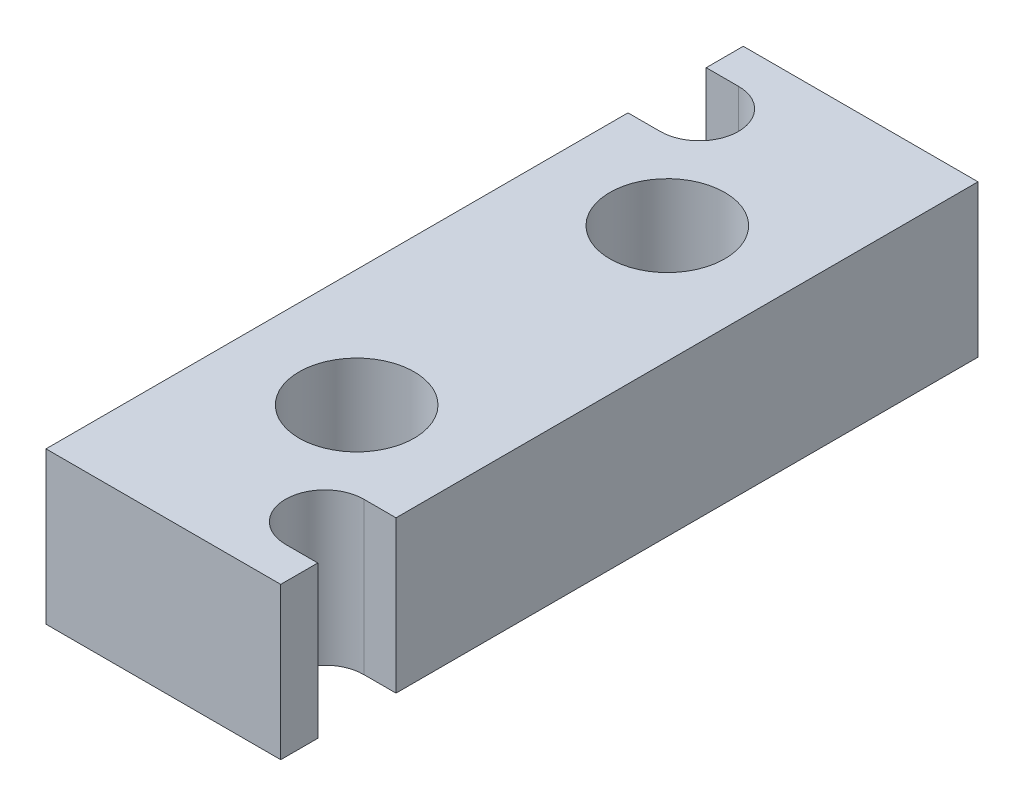
ISO-10303-21;
HEADER;
FILE_DESCRIPTION(('STEP AP214'),'2;1');
FILE_NAME('part.step','',(''),(''),'','','');
FILE_SCHEMA(('AUTOMOTIVE_DESIGN { 1 0 10303 214 1 1 1 1 }'));
ENDSEC;
DATA;
#1=APPLICATION_CONTEXT('core data for automotive mechanical design processes');
#2=APPLICATION_PROTOCOL_DEFINITION('international standard','automotive_design',2000,#1);
#3=PRODUCT_CONTEXT('',#1,'mechanical');
#4=PRODUCT('Part','Part','',(#3));
#5=PRODUCT_RELATED_PRODUCT_CATEGORY('part','',(#4));
#6=PRODUCT_DEFINITION_FORMATION('','',#4);
#7=PRODUCT_DEFINITION_CONTEXT('part definition',#1,'design');
#8=PRODUCT_DEFINITION('design','',#6,#7);
#9=PRODUCT_DEFINITION_SHAPE('','',#8);
#10=(LENGTH_UNIT() NAMED_UNIT(*) SI_UNIT(.MILLI.,.METRE.));
#11=(NAMED_UNIT(*) PLANE_ANGLE_UNIT() SI_UNIT($,.RADIAN.));
#12=(NAMED_UNIT(*) SI_UNIT($,.STERADIAN.) SOLID_ANGLE_UNIT());
#13=UNCERTAINTY_MEASURE_WITH_UNIT(LENGTH_MEASURE(1.E-05),#10,'distance_accuracy_value','');
#14=(GEOMETRIC_REPRESENTATION_CONTEXT(3) GLOBAL_UNCERTAINTY_ASSIGNED_CONTEXT((#13)) GLOBAL_UNIT_ASSIGNED_CONTEXT((#10,
#11,#12)) REPRESENTATION_CONTEXT('',''));
#15=CARTESIAN_POINT('',(0.,0.,0.));
#16=DIRECTION('',(0.,0.,1.));
#17=DIRECTION('',(1.,0.,0.));
#18=AXIS2_PLACEMENT_3D('',#15,#16,#17);
#19=CARTESIAN_POINT('',(-5.1,6.6,0.));
#20=DIRECTION('',(0.,1.,0.));
#21=DIRECTION('',(0.,0.,1.));
#22=AXIS2_PLACEMENT_3D('',#19,#20,#21);
#23=PLANE('',#22);
#24=CARTESIAN_POINT('',(0.,6.6,-6.75));
#25=DIRECTION('',(0.,1.,0.));
#26=DIRECTION('',(0.,0.,-1.));
#27=AXIS2_PLACEMENT_3D('',#24,#25,#26);
#28=CIRCLE('',#27,2.5);
#29=CARTESIAN_POINT('',(0.,6.6,-9.25));
#30=VERTEX_POINT('',#29);
#31=EDGE_CURVE('E143',#30,#30,#28,.T.);
#32=ORIENTED_EDGE('',*,*,#31,.F.);
#33=EDGE_LOOP('',(#32));
#34=FACE_BOUND('',#33,.T.);
#35=CARTESIAN_POINT('',(0.,6.6,6.75));
#36=DIRECTION('',(0.,1.,0.));
#37=DIRECTION('',(0.,0.,1.));
#38=AXIS2_PLACEMENT_3D('',#35,#36,#37);
#39=CIRCLE('',#38,2.5);
#40=CARTESIAN_POINT('',(0.,6.6,9.25));
#41=VERTEX_POINT('',#40);
#42=EDGE_CURVE('E171',#41,#41,#39,.T.);
#43=ORIENTED_EDGE('',*,*,#42,.F.);
#44=EDGE_LOOP('',(#43));
#45=FACE_BOUND('',#44,.T.);
#46=DIRECTION('',(0.,0.,1.));
#47=VECTOR('',#46,1.);
#48=CARTESIAN_POINT('',(-5.1,6.6,0.));
#49=LINE('',#48,#47);
#50=CARTESIAN_POINT('',(-5.1,6.6,-15.15));
#51=VERTEX_POINT('',#50);
#52=CARTESIAN_POINT('',(-5.10000000000009,6.6,-13.54));
#53=VERTEX_POINT('',#52);
#54=EDGE_CURVE('E196',#51,#53,#49,.T.);
#55=ORIENTED_EDGE('',*,*,#54,.T.);
#56=DIRECTION('',(-1.,0.,0.));
#57=VECTOR('',#56,1.);
#58=CARTESIAN_POINT('',(-3.70000000000009,6.6,-13.54));
#59=LINE('',#58,#57);
#60=CARTESIAN_POINT('',(-3.70000000000009,6.6,-13.54));
#61=VERTEX_POINT('',#60);
#62=EDGE_CURVE('E132',#61,#53,#59,.T.);
#63=ORIENTED_EDGE('',*,*,#62,.F.);
#64=CARTESIAN_POINT('',(-3.70000000000008,6.6,-11.84));
#65=DIRECTION('',(0.,1.,0.));
#66=DIRECTION('',(0.,0.,-1.));
#67=AXIS2_PLACEMENT_3D('',#64,#65,#66);
#68=CIRCLE('',#67,1.7);
#69=CARTESIAN_POINT('',(-3.70000000000007,6.6,-10.14));
#70=VERTEX_POINT('',#69);
#71=EDGE_CURVE('E123',#70,#61,#68,.T.);
#72=ORIENTED_EDGE('',*,*,#71,.F.);
#73=DIRECTION('',(1.,0.,0.));
#74=VECTOR('',#73,1.);
#75=CARTESIAN_POINT('',(-3.70000000000007,6.6,-10.14));
#76=LINE('',#75,#74);
#77=CARTESIAN_POINT('',(-5.10000000000007,6.6,-10.14));
#78=VERTEX_POINT('',#77);
#79=EDGE_CURVE('E134',#78,#70,#76,.T.);
#80=ORIENTED_EDGE('',*,*,#79,.F.);
#81=CARTESIAN_POINT('',(-5.1,6.6,15.15));
#82=VERTEX_POINT('',#81);
#83=EDGE_CURVE('E195',#78,#82,#49,.T.);
#84=ORIENTED_EDGE('',*,*,#83,.T.);
#85=DIRECTION('',(1.,0.,0.));
#86=VECTOR('',#85,1.);
#87=CARTESIAN_POINT('',(-5.1,6.6,15.15));
#88=LINE('',#87,#86);
#89=CARTESIAN_POINT('',(5.1,6.6,15.15));
#90=VERTEX_POINT('',#89);
#91=EDGE_CURVE('E199',#82,#90,#88,.T.);
#92=ORIENTED_EDGE('',*,*,#91,.T.);
#93=DIRECTION('',(0.,0.,-1.));
#94=VECTOR('',#93,1.);
#95=CARTESIAN_POINT('',(5.1,6.6,0.));
#96=LINE('',#95,#94);
#97=CARTESIAN_POINT('',(5.1,6.6,13.54));
#98=VERTEX_POINT('',#97);
#99=EDGE_CURVE('E202',#90,#98,#96,.T.);
#100=ORIENTED_EDGE('',*,*,#99,.T.);
#101=DIRECTION('',(1.,0.,0.));
#102=VECTOR('',#101,1.);
#103=CARTESIAN_POINT('',(3.7,6.6,13.54));
#104=LINE('',#103,#102);
#105=CARTESIAN_POINT('',(3.7,6.6,13.54));
#106=VERTEX_POINT('',#105);
#107=EDGE_CURVE('E155',#106,#98,#104,.T.);
#108=ORIENTED_EDGE('',*,*,#107,.F.);
#109=CARTESIAN_POINT('',(3.7,6.6,11.84));
#110=DIRECTION('',(0.,1.,0.));
#111=DIRECTION('',(0.,0.,1.));
#112=AXIS2_PLACEMENT_3D('',#109,#110,#111);
#113=CIRCLE('',#112,1.7);
#114=CARTESIAN_POINT('',(3.7,6.6,10.14));
#115=VERTEX_POINT('',#114);
#116=EDGE_CURVE('E153',#115,#106,#113,.T.);
#117=ORIENTED_EDGE('',*,*,#116,.F.);
#118=DIRECTION('',(-1.,0.,0.));
#119=VECTOR('',#118,1.);
#120=CARTESIAN_POINT('',(3.7,6.6,10.14));
#121=LINE('',#120,#119);
#122=CARTESIAN_POINT('',(5.1,6.6,10.14));
#123=VERTEX_POINT('',#122);
#124=EDGE_CURVE('E157',#123,#115,#121,.T.);
#125=ORIENTED_EDGE('',*,*,#124,.F.);
#126=CARTESIAN_POINT('',(5.1,6.6,-15.15));
#127=VERTEX_POINT('',#126);
#128=EDGE_CURVE('E201',#123,#127,#96,.T.);
#129=ORIENTED_EDGE('',*,*,#128,.T.);
#130=DIRECTION('',(1.,0.,0.));
#131=VECTOR('',#130,1.);
#132=CARTESIAN_POINT('',(-5.1,6.6,-15.15));
#133=LINE('',#132,#131);
#134=EDGE_CURVE('E177',#51,#127,#133,.T.);
#135=ORIENTED_EDGE('',*,*,#134,.F.);
#136=EDGE_LOOP('',(#55,#63,#72,#80,#84,#92,#100,#108,#117,#125,#129,#135));
#137=FACE_BOUND('',#136,.T.);
#138=ADVANCED_FACE('F17',(#34,#45,#137),#23,.T.);
#139=CARTESIAN_POINT('',(-5.1,0.,0.));
#140=DIRECTION('',(0.,1.,0.));
#141=DIRECTION('',(0.,0.,1.));
#142=AXIS2_PLACEMENT_3D('',#139,#140,#141);
#143=PLANE('',#142);
#144=CARTESIAN_POINT('',(0.,0.,-6.75));
#145=DIRECTION('',(0.,1.,0.));
#146=DIRECTION('',(0.,0.,-1.));
#147=AXIS2_PLACEMENT_3D('',#144,#145,#146);
#148=CIRCLE('',#147,2.5);
#149=CARTESIAN_POINT('',(0.,0.,-9.25));
#150=VERTEX_POINT('',#149);
#151=EDGE_CURVE('E124',#150,#150,#148,.T.);
#152=ORIENTED_EDGE('',*,*,#151,.T.);
#153=EDGE_LOOP('',(#152));
#154=FACE_BOUND('',#153,.T.);
#155=CARTESIAN_POINT('',(0.,0.,6.75));
#156=DIRECTION('',(0.,1.,0.));
#157=DIRECTION('',(0.,0.,1.));
#158=AXIS2_PLACEMENT_3D('',#155,#156,#157);
#159=CIRCLE('',#158,2.5);
#160=CARTESIAN_POINT('',(0.,0.,9.25));
#161=VERTEX_POINT('',#160);
#162=EDGE_CURVE('E168',#161,#161,#159,.T.);
#163=ORIENTED_EDGE('',*,*,#162,.T.);
#164=EDGE_LOOP('',(#163));
#165=FACE_BOUND('',#164,.T.);
#166=DIRECTION('',(-1.,0.,0.));
#167=VECTOR('',#166,1.);
#168=CARTESIAN_POINT('',(-3.70000000000009,0.,-13.54));
#169=LINE('',#168,#167);
#170=CARTESIAN_POINT('',(-3.70000000000009,0.,-13.54));
#171=VERTEX_POINT('',#170);
#172=CARTESIAN_POINT('',(-5.10000000000009,0.,-13.54));
#173=VERTEX_POINT('',#172);
#174=EDGE_CURVE('E106',#171,#173,#169,.T.);
#175=ORIENTED_EDGE('',*,*,#174,.T.);
#176=DIRECTION('',(0.,0.,1.));
#177=VECTOR('',#176,1.);
#178=CARTESIAN_POINT('',(-5.1,0.,0.));
#179=LINE('',#178,#177);
#180=CARTESIAN_POINT('',(-5.1,0.,-15.15));
#181=VERTEX_POINT('',#180);
#182=EDGE_CURVE('E187',#181,#173,#179,.T.);
#183=ORIENTED_EDGE('',*,*,#182,.F.);
#184=DIRECTION('',(1.,0.,0.));
#185=VECTOR('',#184,1.);
#186=CARTESIAN_POINT('',(-5.1,0.,-15.15));
#187=LINE('',#186,#185);
#188=CARTESIAN_POINT('',(5.1,0.,-15.15));
#189=VERTEX_POINT('',#188);
#190=EDGE_CURVE('E174',#181,#189,#187,.T.);
#191=ORIENTED_EDGE('',*,*,#190,.T.);
#192=DIRECTION('',(0.,0.,-1.));
#193=VECTOR('',#192,1.);
#194=CARTESIAN_POINT('',(5.1,0.,0.));
#195=LINE('',#194,#193);
#196=CARTESIAN_POINT('',(5.1,0.,10.14));
#197=VERTEX_POINT('',#196);
#198=EDGE_CURVE('E191',#197,#189,#195,.T.);
#199=ORIENTED_EDGE('',*,*,#198,.F.);
#200=DIRECTION('',(-1.,0.,0.));
#201=VECTOR('',#200,1.);
#202=CARTESIAN_POINT('',(3.7,0.,10.14));
#203=LINE('',#202,#201);
#204=CARTESIAN_POINT('',(3.7,0.,10.14));
#205=VERTEX_POINT('',#204);
#206=EDGE_CURVE('E40',#197,#205,#203,.T.);
#207=ORIENTED_EDGE('',*,*,#206,.T.);
#208=CARTESIAN_POINT('',(3.7,0.,11.84));
#209=DIRECTION('',(0.,1.,0.));
#210=DIRECTION('',(0.,0.,1.));
#211=AXIS2_PLACEMENT_3D('',#208,#209,#210);
#212=CIRCLE('',#211,1.7);
#213=CARTESIAN_POINT('',(3.7,0.,13.54));
#214=VERTEX_POINT('',#213);
#215=EDGE_CURVE('E146',#205,#214,#212,.T.);
#216=ORIENTED_EDGE('',*,*,#215,.T.);
#217=DIRECTION('',(1.,0.,0.));
#218=VECTOR('',#217,1.);
#219=CARTESIAN_POINT('',(3.7,0.,13.54));
#220=LINE('',#219,#218);
#221=CARTESIAN_POINT('',(5.1,0.,13.54));
#222=VERTEX_POINT('',#221);
#223=EDGE_CURVE('E149',#214,#222,#220,.T.);
#224=ORIENTED_EDGE('',*,*,#223,.T.);
#225=CARTESIAN_POINT('',(5.1,0.,15.15));
#226=VERTEX_POINT('',#225);
#227=EDGE_CURVE('E192',#226,#222,#195,.T.);
#228=ORIENTED_EDGE('',*,*,#227,.F.);
#229=DIRECTION('',(1.,0.,0.));
#230=VECTOR('',#229,1.);
#231=CARTESIAN_POINT('',(-5.1,0.,15.15));
#232=LINE('',#231,#230);
#233=CARTESIAN_POINT('',(-5.1,0.,15.15));
#234=VERTEX_POINT('',#233);
#235=EDGE_CURVE('E189',#234,#226,#232,.T.);
#236=ORIENTED_EDGE('',*,*,#235,.F.);
#237=CARTESIAN_POINT('',(-5.1,0.,-10.14));
#238=VERTEX_POINT('',#237);
#239=EDGE_CURVE('E186',#238,#234,#179,.T.);
#240=ORIENTED_EDGE('',*,*,#239,.F.);
#241=DIRECTION('',(1.,0.,0.));
#242=VECTOR('',#241,1.);
#243=CARTESIAN_POINT('',(-3.70000000000007,0.,-10.14));
#244=LINE('',#243,#242);
#245=CARTESIAN_POINT('',(-3.70000000000007,0.,-10.14));
#246=VERTEX_POINT('',#245);
#247=EDGE_CURVE('E32',#238,#246,#244,.T.);
#248=ORIENTED_EDGE('',*,*,#247,.T.);
#249=CARTESIAN_POINT('',(-3.70000000000008,0.,-11.84));
#250=DIRECTION('',(0.,1.,0.));
#251=DIRECTION('',(0.,0.,-1.));
#252=AXIS2_PLACEMENT_3D('',#249,#250,#251);
#253=CIRCLE('',#252,1.7);
#254=EDGE_CURVE('E116',#246,#171,#253,.T.);
#255=ORIENTED_EDGE('',*,*,#254,.T.);
#256=EDGE_LOOP('',(#175,#183,#191,#199,#207,#216,#224,#228,#236,#240,#248,#255));
#257=FACE_BOUND('',#256,.T.);
#258=ADVANCED_FACE('F126',(#154,#165,#257),#143,.F.);
#259=CARTESIAN_POINT('',(-5.1,6.6,0.));
#260=DIRECTION('',(1.,0.,0.));
#261=DIRECTION('',(0.,0.,-1.));
#262=AXIS2_PLACEMENT_3D('',#259,#260,#261);
#263=PLANE('',#262);
#264=DIRECTION('',(0.,-1.,0.));
#265=VECTOR('',#264,1.);
#266=CARTESIAN_POINT('',(-5.10000000000009,6.6,-13.54));
#267=LINE('',#266,#265);
#268=EDGE_CURVE('E112',#53,#173,#267,.T.);
#269=ORIENTED_EDGE('',*,*,#268,.F.);
#270=ORIENTED_EDGE('',*,*,#54,.F.);
#271=DIRECTION('',(0.,-1.,0.));
#272=VECTOR('',#271,1.);
#273=CARTESIAN_POINT('',(-5.1,6.6,-15.15));
#274=LINE('',#273,#272);
#275=EDGE_CURVE('E183',#51,#181,#274,.T.);
#276=ORIENTED_EDGE('',*,*,#275,.T.);
#277=ORIENTED_EDGE('',*,*,#182,.T.);
#278=EDGE_LOOP('',(#269,#270,#276,#277));
#279=FACE_BOUND('',#278,.T.);
#280=ADVANCED_FACE('F19',(#279),#263,.F.);
#281=DIRECTION('',(0.,-1.,0.));
#282=VECTOR('',#281,1.);
#283=CARTESIAN_POINT('',(-5.10000000000007,6.6,-10.14));
#284=LINE('',#283,#282);
#285=EDGE_CURVE('E138',#78,#238,#284,.T.);
#286=ORIENTED_EDGE('',*,*,#285,.T.);
#287=ORIENTED_EDGE('',*,*,#239,.T.);
#288=DIRECTION('',(0.,-1.,0.));
#289=VECTOR('',#288,1.);
#290=CARTESIAN_POINT('',(-5.1,6.6,15.15));
#291=LINE('',#290,#289);
#292=EDGE_CURVE('E11',#82,#234,#291,.T.);
#293=ORIENTED_EDGE('',*,*,#292,.F.);
#294=ORIENTED_EDGE('',*,*,#83,.F.);
#295=EDGE_LOOP('',(#286,#287,#293,#294));
#296=FACE_BOUND('',#295,.T.);
#297=ADVANCED_FACE('F231',(#296),#263,.F.);
#298=CARTESIAN_POINT('',(5.1,6.6,0.));
#299=DIRECTION('',(-1.,0.,0.));
#300=DIRECTION('',(0.,0.,1.));
#301=AXIS2_PLACEMENT_3D('',#298,#299,#300);
#302=PLANE('',#301);
#303=DIRECTION('',(0.,-1.,0.));
#304=VECTOR('',#303,1.);
#305=CARTESIAN_POINT('',(5.1,6.6,13.54));
#306=LINE('',#305,#304);
#307=EDGE_CURVE('E163',#98,#222,#306,.T.);
#308=ORIENTED_EDGE('',*,*,#307,.F.);
#309=ORIENTED_EDGE('',*,*,#99,.F.);
#310=DIRECTION('',(0.,-1.,0.));
#311=VECTOR('',#310,1.);
#312=CARTESIAN_POINT('',(5.1,6.6,15.15));
#313=LINE('',#312,#311);
#314=EDGE_CURVE('E25',#90,#226,#313,.T.);
#315=ORIENTED_EDGE('',*,*,#314,.T.);
#316=ORIENTED_EDGE('',*,*,#227,.T.);
#317=EDGE_LOOP('',(#308,#309,#315,#316));
#318=FACE_BOUND('',#317,.T.);
#319=ADVANCED_FACE('F210',(#318),#302,.F.);
#320=DIRECTION('',(0.,-1.,0.));
#321=VECTOR('',#320,1.);
#322=CARTESIAN_POINT('',(5.1,6.6,10.14));
#323=LINE('',#322,#321);
#324=EDGE_CURVE('E161',#123,#197,#323,.T.);
#325=ORIENTED_EDGE('',*,*,#324,.T.);
#326=ORIENTED_EDGE('',*,*,#198,.T.);
#327=DIRECTION('',(0.,-1.,0.));
#328=VECTOR('',#327,1.);
#329=CARTESIAN_POINT('',(5.1,6.6,-15.15));
#330=LINE('',#329,#328);
#331=EDGE_CURVE('E180',#127,#189,#330,.T.);
#332=ORIENTED_EDGE('',*,*,#331,.F.);
#333=ORIENTED_EDGE('',*,*,#128,.F.);
#334=EDGE_LOOP('',(#325,#326,#332,#333));
#335=FACE_BOUND('',#334,.T.);
#336=ADVANCED_FACE('F242',(#335),#302,.F.);
#337=CARTESIAN_POINT('',(-5.1,6.6,15.15));
#338=DIRECTION('',(0.,0.,-1.));
#339=DIRECTION('',(-1.,0.,0.));
#340=AXIS2_PLACEMENT_3D('',#337,#338,#339);
#341=PLANE('',#340);
#342=ORIENTED_EDGE('',*,*,#235,.T.);
#343=ORIENTED_EDGE('',*,*,#314,.F.);
#344=ORIENTED_EDGE('',*,*,#91,.F.);
#345=ORIENTED_EDGE('',*,*,#292,.T.);
#346=EDGE_LOOP('',(#342,#343,#344,#345));
#347=FACE_BOUND('',#346,.T.);
#348=ADVANCED_FACE('F229',(#347),#341,.F.);
#349=CARTESIAN_POINT('',(-5.1,6.6,-15.15));
#350=DIRECTION('',(0.,0.,1.));
#351=DIRECTION('',(-1.,0.,0.));
#352=AXIS2_PLACEMENT_3D('',#349,#350,#351);
#353=PLANE('',#352);
#354=ORIENTED_EDGE('',*,*,#190,.F.);
#355=ORIENTED_EDGE('',*,*,#275,.F.);
#356=ORIENTED_EDGE('',*,*,#134,.T.);
#357=ORIENTED_EDGE('',*,*,#331,.T.);
#358=EDGE_LOOP('',(#354,#355,#356,#357));
#359=FACE_BOUND('',#358,.T.);
#360=ADVANCED_FACE('F239',(#359),#353,.F.);
#361=CARTESIAN_POINT('',(0.,6.6,6.75));
#362=DIRECTION('',(0.,-1.,0.));
#363=DIRECTION('',(0.,0.,-1.));
#364=AXIS2_PLACEMENT_3D('',#361,#362,#363);
#365=CYLINDRICAL_SURFACE('',#364,2.5);
#366=ORIENTED_EDGE('',*,*,#42,.T.);
#367=EDGE_LOOP('',(#366));
#368=FACE_BOUND('',#367,.T.);
#369=ORIENTED_EDGE('',*,*,#162,.F.);
#370=EDGE_LOOP('',(#369));
#371=FACE_BOUND('',#370,.T.);
#372=ADVANCED_FACE('F273',(#368,#371),#365,.F.);
#373=CARTESIAN_POINT('',(3.7,6.6,11.84));
#374=DIRECTION('',(0.,-1.,0.));
#375=DIRECTION('',(0.,0.,-1.));
#376=AXIS2_PLACEMENT_3D('',#373,#374,#375);
#377=CYLINDRICAL_SURFACE('',#376,1.7);
#378=ORIENTED_EDGE('',*,*,#215,.F.);
#379=DIRECTION('',(0.,-1.,0.));
#380=VECTOR('',#379,1.);
#381=CARTESIAN_POINT('',(3.7,6.6,10.14));
#382=LINE('',#381,#380);
#383=EDGE_CURVE('E159',#115,#205,#382,.T.);
#384=ORIENTED_EDGE('',*,*,#383,.F.);
#385=ORIENTED_EDGE('',*,*,#116,.T.);
#386=DIRECTION('',(0.,-1.,0.));
#387=VECTOR('',#386,1.);
#388=CARTESIAN_POINT('',(3.7,6.6,13.54));
#389=LINE('',#388,#387);
#390=EDGE_CURVE('E165',#106,#214,#389,.T.);
#391=ORIENTED_EDGE('',*,*,#390,.T.);
#392=EDGE_LOOP('',(#378,#384,#385,#391));
#393=FACE_BOUND('',#392,.T.);
#394=ADVANCED_FACE('F220',(#393),#377,.F.);
#395=CARTESIAN_POINT('',(3.7,6.6,13.54));
#396=DIRECTION('',(0.,0.,-1.));
#397=DIRECTION('',(-1.,0.,0.));
#398=AXIS2_PLACEMENT_3D('',#395,#396,#397);
#399=PLANE('',#398);
#400=ORIENTED_EDGE('',*,*,#223,.F.);
#401=ORIENTED_EDGE('',*,*,#390,.F.);
#402=ORIENTED_EDGE('',*,*,#107,.T.);
#403=ORIENTED_EDGE('',*,*,#307,.T.);
#404=EDGE_LOOP('',(#400,#401,#402,#403));
#405=FACE_BOUND('',#404,.T.);
#406=ADVANCED_FACE('F217',(#405),#399,.T.);
#407=CARTESIAN_POINT('',(3.7,6.6,10.14));
#408=DIRECTION('',(0.,0.,1.));
#409=DIRECTION('',(1.,0.,0.));
#410=AXIS2_PLACEMENT_3D('',#407,#408,#409);
#411=PLANE('',#410);
#412=ORIENTED_EDGE('',*,*,#206,.F.);
#413=ORIENTED_EDGE('',*,*,#324,.F.);
#414=ORIENTED_EDGE('',*,*,#124,.T.);
#415=ORIENTED_EDGE('',*,*,#383,.T.);
#416=EDGE_LOOP('',(#412,#413,#414,#415));
#417=FACE_BOUND('',#416,.T.);
#418=ADVANCED_FACE('F243',(#417),#411,.T.);
#419=CARTESIAN_POINT('',(0.,6.6,-6.75));
#420=DIRECTION('',(0.,-1.,0.));
#421=DIRECTION('',(0.,0.,-1.));
#422=AXIS2_PLACEMENT_3D('',#419,#420,#421);
#423=CYLINDRICAL_SURFACE('',#422,2.5);
#424=ORIENTED_EDGE('',*,*,#31,.T.);
#425=EDGE_LOOP('',(#424));
#426=FACE_BOUND('',#425,.T.);
#427=ORIENTED_EDGE('',*,*,#151,.F.);
#428=EDGE_LOOP('',(#427));
#429=FACE_BOUND('',#428,.T.);
#430=ADVANCED_FACE('F245',(#426,#429),#423,.F.);
#431=CARTESIAN_POINT('',(-3.70000000000008,6.6,-11.84));
#432=DIRECTION('',(0.,-1.,0.));
#433=DIRECTION('',(0.,0.,-1.));
#434=AXIS2_PLACEMENT_3D('',#431,#432,#433);
#435=CYLINDRICAL_SURFACE('',#434,1.7);
#436=ORIENTED_EDGE('',*,*,#254,.F.);
#437=DIRECTION('',(0.,-1.,0.));
#438=VECTOR('',#437,1.);
#439=CARTESIAN_POINT('',(-3.70000000000007,6.6,-10.14));
#440=LINE('',#439,#438);
#441=EDGE_CURVE('E136',#70,#246,#440,.T.);
#442=ORIENTED_EDGE('',*,*,#441,.F.);
#443=ORIENTED_EDGE('',*,*,#71,.T.);
#444=DIRECTION('',(0.,-1.,0.));
#445=VECTOR('',#444,1.);
#446=CARTESIAN_POINT('',(-3.70000000000009,6.6,-13.54));
#447=LINE('',#446,#445);
#448=EDGE_CURVE('E109',#61,#171,#447,.T.);
#449=ORIENTED_EDGE('',*,*,#448,.T.);
#450=EDGE_LOOP('',(#436,#442,#443,#449));
#451=FACE_BOUND('',#450,.T.);
#452=ADVANCED_FACE('F120',(#451),#435,.F.);
#453=CARTESIAN_POINT('',(-3.70000000000009,6.6,-13.54));
#454=DIRECTION('',(0.,0.,1.));
#455=DIRECTION('',(1.,0.,0.));
#456=AXIS2_PLACEMENT_3D('',#453,#454,#455);
#457=PLANE('',#456);
#458=ORIENTED_EDGE('',*,*,#174,.F.);
#459=ORIENTED_EDGE('',*,*,#448,.F.);
#460=ORIENTED_EDGE('',*,*,#62,.T.);
#461=ORIENTED_EDGE('',*,*,#268,.T.);
#462=EDGE_LOOP('',(#458,#459,#460,#461));
#463=FACE_BOUND('',#462,.T.);
#464=ADVANCED_FACE('F108',(#463),#457,.T.);
#465=CARTESIAN_POINT('',(-3.70000000000007,6.6,-10.14));
#466=DIRECTION('',(0.,0.,-1.));
#467=DIRECTION('',(-1.,0.,0.));
#468=AXIS2_PLACEMENT_3D('',#465,#466,#467);
#469=PLANE('',#468);
#470=ORIENTED_EDGE('',*,*,#247,.F.);
#471=ORIENTED_EDGE('',*,*,#285,.F.);
#472=ORIENTED_EDGE('',*,*,#79,.T.);
#473=ORIENTED_EDGE('',*,*,#441,.T.);
#474=EDGE_LOOP('',(#470,#471,#472,#473));
#475=FACE_BOUND('',#474,.T.);
#476=ADVANCED_FACE('F232',(#475),#469,.T.);
#477=CLOSED_SHELL('',(#138,#258,#280,#297,#319,#336,#348,#360,#372,#394,#406,#418,#430,#452,
#464,#476));
#478=MANIFOLD_SOLID_BREP('B1',#477);
#479=ADVANCED_BREP_SHAPE_REPRESENTATION('',(#18,#478),#14);
#480=SHAPE_DEFINITION_REPRESENTATION(#9,#479);
ENDSEC;
END-ISO-10303-21;
